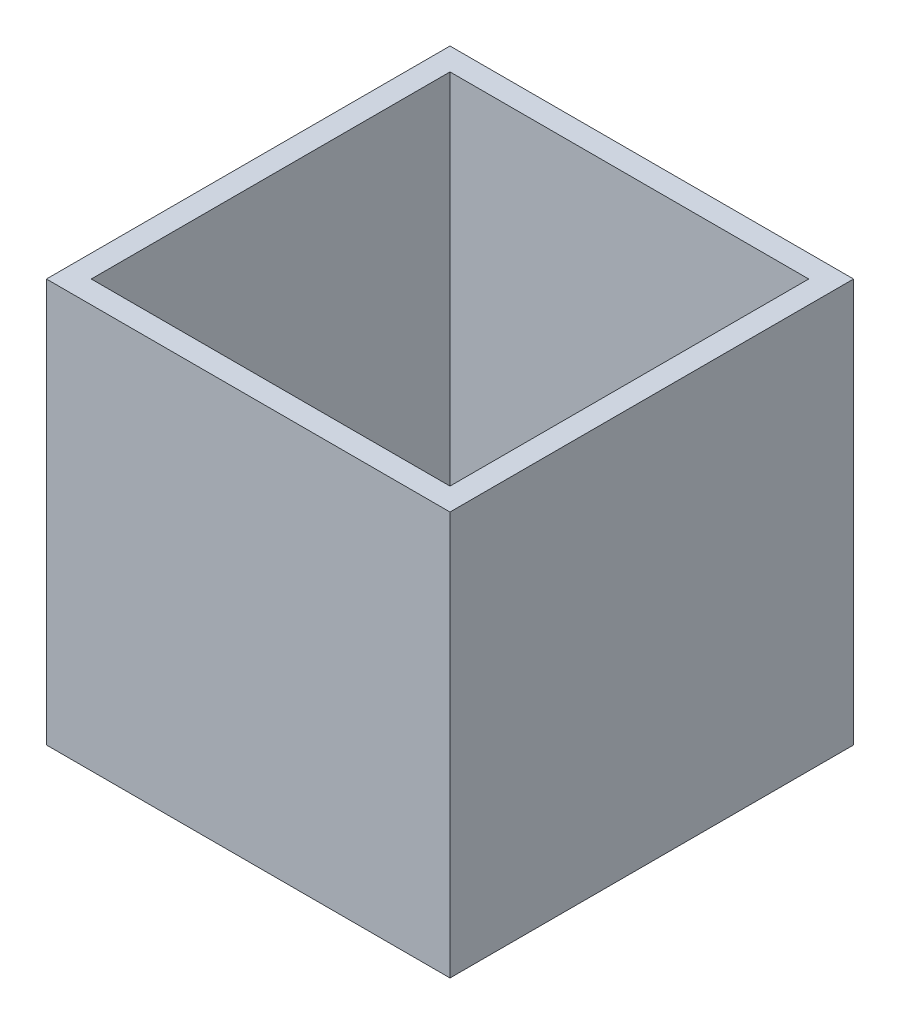
ISO-10303-21;
HEADER;
FILE_DESCRIPTION(('STEP AP214'),'2;1');
FILE_NAME('part.step','',(''),(''),'','','');
FILE_SCHEMA(('AUTOMOTIVE_DESIGN { 1 0 10303 214 1 1 1 1 }'));
ENDSEC;
DATA;
#1=APPLICATION_CONTEXT('core data for automotive mechanical design processes');
#2=APPLICATION_PROTOCOL_DEFINITION('international standard','automotive_design',2000,#1);
#3=PRODUCT_CONTEXT('',#1,'mechanical');
#4=PRODUCT('Part','Part','',(#3));
#5=PRODUCT_RELATED_PRODUCT_CATEGORY('part','',(#4));
#6=PRODUCT_DEFINITION_FORMATION('','',#4);
#7=PRODUCT_DEFINITION_CONTEXT('part definition',#1,'design');
#8=PRODUCT_DEFINITION('design','',#6,#7);
#9=PRODUCT_DEFINITION_SHAPE('','',#8);
#10=(LENGTH_UNIT() NAMED_UNIT(*) SI_UNIT(.MILLI.,.METRE.));
#11=(NAMED_UNIT(*) PLANE_ANGLE_UNIT() SI_UNIT($,.RADIAN.));
#12=(NAMED_UNIT(*) SI_UNIT($,.STERADIAN.) SOLID_ANGLE_UNIT());
#13=UNCERTAINTY_MEASURE_WITH_UNIT(LENGTH_MEASURE(1.E-05),#10,'distance_accuracy_value','');
#14=(GEOMETRIC_REPRESENTATION_CONTEXT(3) GLOBAL_UNCERTAINTY_ASSIGNED_CONTEXT((#13)) GLOBAL_UNIT_ASSIGNED_CONTEXT((#10,
#11,#12)) REPRESENTATION_CONTEXT('',''));
#15=CARTESIAN_POINT('',(0.,0.,0.));
#16=DIRECTION('',(0.,0.,1.));
#17=DIRECTION('',(1.,0.,0.));
#18=AXIS2_PLACEMENT_3D('',#15,#16,#17);
#19=CARTESIAN_POINT('',(0.,18.,0.));
#20=DIRECTION('',(0.,-1.,0.));
#21=DIRECTION('',(0.,0.,-1.));
#22=AXIS2_PLACEMENT_3D('',#19,#20,#21);
#23=PLANE('',#22);
#24=DIRECTION('',(0.,0.,1.));
#25=VECTOR('',#24,1.);
#26=CARTESIAN_POINT('',(-9.,18.,-9.));
#27=LINE('',#26,#25);
#28=CARTESIAN_POINT('',(-9.,18.,-9.));
#29=VERTEX_POINT('',#28);
#30=CARTESIAN_POINT('',(-9.,18.,9.));
#31=VERTEX_POINT('',#30);
#32=EDGE_CURVE('E157',#29,#31,#27,.T.);
#33=ORIENTED_EDGE('',*,*,#32,.T.);
#34=DIRECTION('',(1.,0.,0.));
#35=VECTOR('',#34,1.);
#36=CARTESIAN_POINT('',(9.,18.,9.));
#37=LINE('',#36,#35);
#38=CARTESIAN_POINT('',(9.,18.,9.));
#39=VERTEX_POINT('',#38);
#40=EDGE_CURVE('E92',#31,#39,#37,.T.);
#41=ORIENTED_EDGE('',*,*,#40,.T.);
#42=DIRECTION('',(0.,0.,-1.));
#43=VECTOR('',#42,1.);
#44=CARTESIAN_POINT('',(9.,18.,-9.));
#45=LINE('',#44,#43);
#46=CARTESIAN_POINT('',(9.,18.,-9.));
#47=VERTEX_POINT('',#46);
#48=EDGE_CURVE('E162',#39,#47,#45,.T.);
#49=ORIENTED_EDGE('',*,*,#48,.T.);
#50=DIRECTION('',(-1.,0.,0.));
#51=VECTOR('',#50,1.);
#52=CARTESIAN_POINT('',(9.,18.,-9.));
#53=LINE('',#52,#51);
#54=EDGE_CURVE('E64',#47,#29,#53,.T.);
#55=ORIENTED_EDGE('',*,*,#54,.T.);
#56=EDGE_LOOP('',(#33,#41,#49,#55));
#57=FACE_BOUND('',#56,.T.);
#58=DIRECTION('',(0.,0.,1.));
#59=VECTOR('',#58,1.);
#60=CARTESIAN_POINT('',(-8.,18.,0.));
#61=LINE('',#60,#59);
#62=CARTESIAN_POINT('',(-8.,18.,-8.));
#63=VERTEX_POINT('',#62);
#64=CARTESIAN_POINT('',(-8.,18.,8.));
#65=VERTEX_POINT('',#64);
#66=EDGE_CURVE('E141',#63,#65,#61,.T.);
#67=ORIENTED_EDGE('',*,*,#66,.F.);
#68=DIRECTION('',(-1.,0.,0.));
#69=VECTOR('',#68,1.);
#70=CARTESIAN_POINT('',(0.,18.,-8.));
#71=LINE('',#70,#69);
#72=CARTESIAN_POINT('',(8.,18.,-8.));
#73=VERTEX_POINT('',#72);
#74=EDGE_CURVE('E154',#73,#63,#71,.T.);
#75=ORIENTED_EDGE('',*,*,#74,.F.);
#76=DIRECTION('',(0.,0.,-1.));
#77=VECTOR('',#76,1.);
#78=CARTESIAN_POINT('',(8.,18.,0.));
#79=LINE('',#78,#77);
#80=CARTESIAN_POINT('',(8.,18.,8.));
#81=VERTEX_POINT('',#80);
#82=EDGE_CURVE('E151',#81,#73,#79,.T.);
#83=ORIENTED_EDGE('',*,*,#82,.F.);
#84=DIRECTION('',(1.,0.,0.));
#85=VECTOR('',#84,1.);
#86=CARTESIAN_POINT('',(0.,18.,8.));
#87=LINE('',#86,#85);
#88=EDGE_CURVE('E130',#65,#81,#87,.T.);
#89=ORIENTED_EDGE('',*,*,#88,.F.);
#90=EDGE_LOOP('',(#67,#75,#83,#89));
#91=FACE_BOUND('',#90,.T.);
#92=ADVANCED_FACE('F39',(#57,#91),#23,.F.);
#93=CARTESIAN_POINT('',(-9.,18.,-9.));
#94=DIRECTION('',(1.,0.,0.));
#95=DIRECTION('',(0.,0.,-1.));
#96=AXIS2_PLACEMENT_3D('',#93,#94,#95);
#97=PLANE('',#96);
#98=DIRECTION('',(0.,0.,1.));
#99=VECTOR('',#98,1.);
#100=CARTESIAN_POINT('',(-9.,0.,-9.));
#101=LINE('',#100,#99);
#102=CARTESIAN_POINT('',(-9.,0.,-9.));
#103=VERTEX_POINT('',#102);
#104=CARTESIAN_POINT('',(-9.,0.,9.));
#105=VERTEX_POINT('',#104);
#106=EDGE_CURVE('E168',#103,#105,#101,.T.);
#107=ORIENTED_EDGE('',*,*,#106,.T.);
#108=DIRECTION('',(0.,-1.,0.));
#109=VECTOR('',#108,1.);
#110=CARTESIAN_POINT('',(-9.,18.,9.));
#111=LINE('',#110,#109);
#112=EDGE_CURVE('E11',#31,#105,#111,.T.);
#113=ORIENTED_EDGE('',*,*,#112,.F.);
#114=ORIENTED_EDGE('',*,*,#32,.F.);
#115=DIRECTION('',(0.,-1.,0.));
#116=VECTOR('',#115,1.);
#117=CARTESIAN_POINT('',(-9.,18.,-9.));
#118=LINE('',#117,#116);
#119=EDGE_CURVE('E167',#29,#103,#118,.T.);
#120=ORIENTED_EDGE('',*,*,#119,.T.);
#121=EDGE_LOOP('',(#107,#113,#114,#120));
#122=FACE_BOUND('',#121,.T.);
#123=ADVANCED_FACE('F41',(#122),#97,.F.);
#124=CARTESIAN_POINT('',(9.,18.,9.));
#125=DIRECTION('',(0.,0.,-1.));
#126=DIRECTION('',(-1.,0.,0.));
#127=AXIS2_PLACEMENT_3D('',#124,#125,#126);
#128=PLANE('',#127);
#129=DIRECTION('',(1.,0.,0.));
#130=VECTOR('',#129,1.);
#131=CARTESIAN_POINT('',(9.,0.,9.));
#132=LINE('',#131,#130);
#133=CARTESIAN_POINT('',(9.,0.,9.));
#134=VERTEX_POINT('',#133);
#135=EDGE_CURVE('E172',#105,#134,#132,.T.);
#136=ORIENTED_EDGE('',*,*,#135,.T.);
#137=DIRECTION('',(0.,-1.,0.));
#138=VECTOR('',#137,1.);
#139=CARTESIAN_POINT('',(9.,18.,9.));
#140=LINE('',#139,#138);
#141=EDGE_CURVE('E48',#39,#134,#140,.T.);
#142=ORIENTED_EDGE('',*,*,#141,.F.);
#143=ORIENTED_EDGE('',*,*,#40,.F.);
#144=ORIENTED_EDGE('',*,*,#112,.T.);
#145=EDGE_LOOP('',(#136,#142,#143,#144));
#146=FACE_BOUND('',#145,.T.);
#147=ADVANCED_FACE('F206',(#146),#128,.F.);
#148=CARTESIAN_POINT('',(9.,18.,-9.));
#149=DIRECTION('',(-1.,0.,0.));
#150=DIRECTION('',(0.,0.,1.));
#151=AXIS2_PLACEMENT_3D('',#148,#149,#150);
#152=PLANE('',#151);
#153=DIRECTION('',(0.,0.,-1.));
#154=VECTOR('',#153,1.);
#155=CARTESIAN_POINT('',(9.,0.,-9.));
#156=LINE('',#155,#154);
#157=CARTESIAN_POINT('',(9.,0.,-9.));
#158=VERTEX_POINT('',#157);
#159=EDGE_CURVE('E175',#134,#158,#156,.T.);
#160=ORIENTED_EDGE('',*,*,#159,.T.);
#161=DIRECTION('',(0.,-1.,0.));
#162=VECTOR('',#161,1.);
#163=CARTESIAN_POINT('',(9.,18.,-9.));
#164=LINE('',#163,#162);
#165=EDGE_CURVE('E182',#47,#158,#164,.T.);
#166=ORIENTED_EDGE('',*,*,#165,.F.);
#167=ORIENTED_EDGE('',*,*,#48,.F.);
#168=ORIENTED_EDGE('',*,*,#141,.T.);
#169=EDGE_LOOP('',(#160,#166,#167,#168));
#170=FACE_BOUND('',#169,.T.);
#171=ADVANCED_FACE('F189',(#170),#152,.F.);
#172=CARTESIAN_POINT('',(9.,18.,-9.));
#173=DIRECTION('',(0.,0.,1.));
#174=DIRECTION('',(1.,0.,0.));
#175=AXIS2_PLACEMENT_3D('',#172,#173,#174);
#176=PLANE('',#175);
#177=DIRECTION('',(-1.,0.,0.));
#178=VECTOR('',#177,1.);
#179=CARTESIAN_POINT('',(9.,0.,-9.));
#180=LINE('',#179,#178);
#181=EDGE_CURVE('E85',#158,#103,#180,.T.);
#182=ORIENTED_EDGE('',*,*,#181,.T.);
#183=ORIENTED_EDGE('',*,*,#119,.F.);
#184=ORIENTED_EDGE('',*,*,#54,.F.);
#185=ORIENTED_EDGE('',*,*,#165,.T.);
#186=EDGE_LOOP('',(#182,#183,#184,#185));
#187=FACE_BOUND('',#186,.T.);
#188=ADVANCED_FACE('F197',(#187),#176,.F.);
#189=CARTESIAN_POINT('',(0.,0.,0.));
#190=DIRECTION('',(0.,-1.,0.));
#191=DIRECTION('',(0.,0.,-1.));
#192=AXIS2_PLACEMENT_3D('',#189,#190,#191);
#193=PLANE('',#192);
#194=ORIENTED_EDGE('',*,*,#106,.F.);
#195=ORIENTED_EDGE('',*,*,#181,.F.);
#196=ORIENTED_EDGE('',*,*,#159,.F.);
#197=ORIENTED_EDGE('',*,*,#135,.F.);
#198=EDGE_LOOP('',(#194,#195,#196,#197));
#199=FACE_BOUND('',#198,.T.);
#200=ADVANCED_FACE('F193',(#199),#193,.T.);
#201=CARTESIAN_POINT('',(-8.,18.,-9.));
#202=DIRECTION('',(1.,0.,0.));
#203=DIRECTION('',(0.,0.,-1.));
#204=AXIS2_PLACEMENT_3D('',#201,#202,#203);
#205=PLANE('',#204);
#206=DIRECTION('',(0.,0.,1.));
#207=VECTOR('',#206,1.);
#208=CARTESIAN_POINT('',(-8.,1.,0.));
#209=LINE('',#208,#207);
#210=CARTESIAN_POINT('',(-8.,1.,-8.));
#211=VERTEX_POINT('',#210);
#212=CARTESIAN_POINT('',(-8.,1.,8.));
#213=VERTEX_POINT('',#212);
#214=EDGE_CURVE('E120',#211,#213,#209,.T.);
#215=ORIENTED_EDGE('',*,*,#214,.F.);
#216=DIRECTION('',(0.,-1.,0.));
#217=VECTOR('',#216,1.);
#218=CARTESIAN_POINT('',(-8.,18.,-8.));
#219=LINE('',#218,#217);
#220=EDGE_CURVE('E145',#63,#211,#219,.T.);
#221=ORIENTED_EDGE('',*,*,#220,.F.);
#222=ORIENTED_EDGE('',*,*,#66,.T.);
#223=DIRECTION('',(0.,-1.,0.));
#224=VECTOR('',#223,1.);
#225=CARTESIAN_POINT('',(-8.,18.,8.));
#226=LINE('',#225,#224);
#227=EDGE_CURVE('E134',#65,#213,#226,.T.);
#228=ORIENTED_EDGE('',*,*,#227,.T.);
#229=EDGE_LOOP('',(#215,#221,#222,#228));
#230=FACE_BOUND('',#229,.T.);
#231=ADVANCED_FACE('F204',(#230),#205,.T.);
#232=CARTESIAN_POINT('',(9.,18.,8.));
#233=DIRECTION('',(0.,0.,-1.));
#234=DIRECTION('',(-1.,0.,0.));
#235=AXIS2_PLACEMENT_3D('',#232,#233,#234);
#236=PLANE('',#235);
#237=DIRECTION('',(1.,0.,0.));
#238=VECTOR('',#237,1.);
#239=CARTESIAN_POINT('',(0.,1.,8.));
#240=LINE('',#239,#238);
#241=CARTESIAN_POINT('',(8.,1.,8.));
#242=VERTEX_POINT('',#241);
#243=EDGE_CURVE('E114',#213,#242,#240,.T.);
#244=ORIENTED_EDGE('',*,*,#243,.F.);
#245=ORIENTED_EDGE('',*,*,#227,.F.);
#246=ORIENTED_EDGE('',*,*,#88,.T.);
#247=DIRECTION('',(0.,-1.,0.));
#248=VECTOR('',#247,1.);
#249=CARTESIAN_POINT('',(8.,18.,8.));
#250=LINE('',#249,#248);
#251=EDGE_CURVE('E127',#81,#242,#250,.T.);
#252=ORIENTED_EDGE('',*,*,#251,.T.);
#253=EDGE_LOOP('',(#244,#245,#246,#252));
#254=FACE_BOUND('',#253,.T.);
#255=ADVANCED_FACE('F128',(#254),#236,.T.);
#256=CARTESIAN_POINT('',(8.,18.,-9.));
#257=DIRECTION('',(-1.,0.,0.));
#258=DIRECTION('',(0.,0.,1.));
#259=AXIS2_PLACEMENT_3D('',#256,#257,#258);
#260=PLANE('',#259);
#261=DIRECTION('',(0.,0.,-1.));
#262=VECTOR('',#261,1.);
#263=CARTESIAN_POINT('',(8.,1.,0.));
#264=LINE('',#263,#262);
#265=CARTESIAN_POINT('',(8.,1.,-8.));
#266=VERTEX_POINT('',#265);
#267=EDGE_CURVE('E118',#242,#266,#264,.T.);
#268=ORIENTED_EDGE('',*,*,#267,.F.);
#269=ORIENTED_EDGE('',*,*,#251,.F.);
#270=ORIENTED_EDGE('',*,*,#82,.T.);
#271=DIRECTION('',(0.,-1.,0.));
#272=VECTOR('',#271,1.);
#273=CARTESIAN_POINT('',(8.,18.,-8.));
#274=LINE('',#273,#272);
#275=EDGE_CURVE('E55',#73,#266,#274,.T.);
#276=ORIENTED_EDGE('',*,*,#275,.T.);
#277=EDGE_LOOP('',(#268,#269,#270,#276));
#278=FACE_BOUND('',#277,.T.);
#279=ADVANCED_FACE('F136',(#278),#260,.T.);
#280=CARTESIAN_POINT('',(9.,18.,-8.));
#281=DIRECTION('',(0.,0.,1.));
#282=DIRECTION('',(1.,0.,0.));
#283=AXIS2_PLACEMENT_3D('',#280,#281,#282);
#284=PLANE('',#283);
#285=DIRECTION('',(-1.,0.,0.));
#286=VECTOR('',#285,1.);
#287=CARTESIAN_POINT('',(0.,1.,-8.));
#288=LINE('',#287,#286);
#289=EDGE_CURVE('E138',#266,#211,#288,.T.);
#290=ORIENTED_EDGE('',*,*,#289,.F.);
#291=ORIENTED_EDGE('',*,*,#275,.F.);
#292=ORIENTED_EDGE('',*,*,#74,.T.);
#293=ORIENTED_EDGE('',*,*,#220,.T.);
#294=EDGE_LOOP('',(#290,#291,#292,#293));
#295=FACE_BOUND('',#294,.T.);
#296=ADVANCED_FACE('F217',(#295),#284,.T.);
#297=CARTESIAN_POINT('',(0.,1.,0.));
#298=DIRECTION('',(0.,-1.,0.));
#299=DIRECTION('',(0.,0.,-1.));
#300=AXIS2_PLACEMENT_3D('',#297,#298,#299);
#301=PLANE('',#300);
#302=ORIENTED_EDGE('',*,*,#214,.T.);
#303=ORIENTED_EDGE('',*,*,#243,.T.);
#304=ORIENTED_EDGE('',*,*,#267,.T.);
#305=ORIENTED_EDGE('',*,*,#289,.T.);
#306=EDGE_LOOP('',(#302,#303,#304,#305));
#307=FACE_BOUND('',#306,.T.);
#308=ADVANCED_FACE('F116',(#307),#301,.F.);
#309=CLOSED_SHELL('',(#92,#123,#147,#171,#188,#200,#231,#255,#279,#296,#308));
#310=MANIFOLD_SOLID_BREP('B2',#309);
#311=ADVANCED_BREP_SHAPE_REPRESENTATION('',(#18,#310),#14);
#312=SHAPE_DEFINITION_REPRESENTATION(#9,#311);
ENDSEC;
END-ISO-10303-21;
